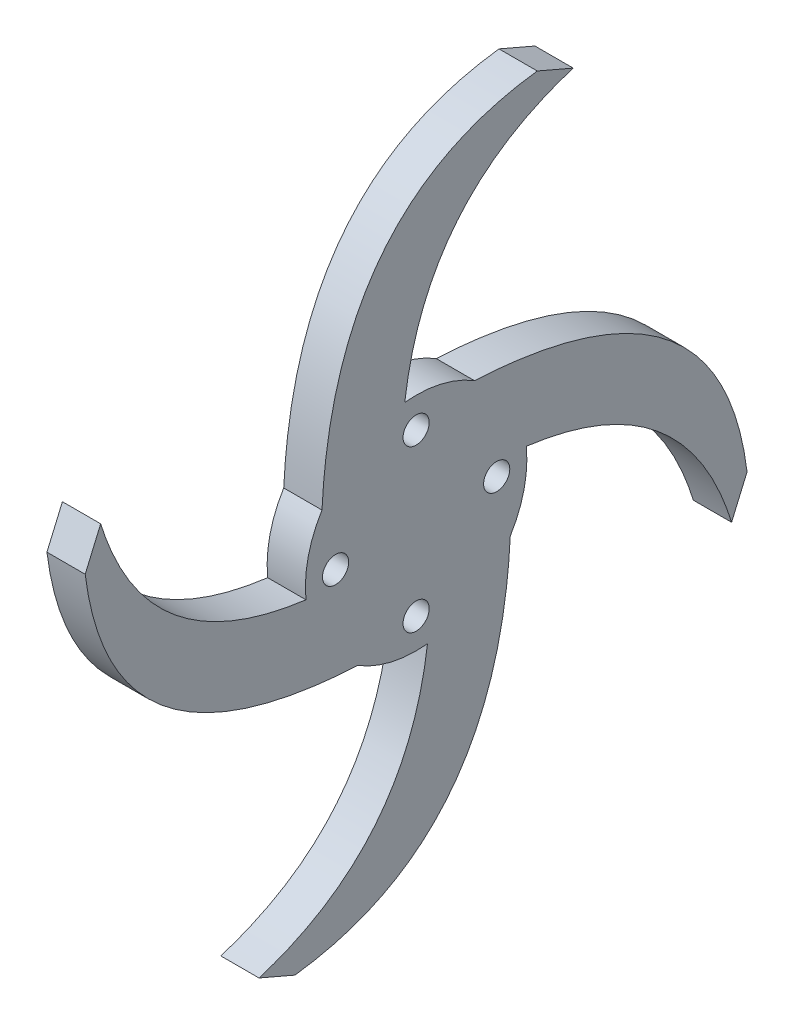
ISO-10303-21;
HEADER;
FILE_DESCRIPTION(('STEP AP214'),'2;1');
FILE_NAME('part.step','',(''),(''),'','','');
FILE_SCHEMA(('AUTOMOTIVE_DESIGN { 1 0 10303 214 1 1 1 1 }'));
ENDSEC;
DATA;
#1=APPLICATION_CONTEXT('core data for automotive mechanical design processes');
#2=APPLICATION_PROTOCOL_DEFINITION('international standard','automotive_design',2000,#1);
#3=PRODUCT_CONTEXT('',#1,'mechanical');
#4=PRODUCT('Part','Part','',(#3));
#5=PRODUCT_RELATED_PRODUCT_CATEGORY('part','',(#4));
#6=PRODUCT_DEFINITION_FORMATION('','',#4);
#7=PRODUCT_DEFINITION_CONTEXT('part definition',#1,'design');
#8=PRODUCT_DEFINITION('design','',#6,#7);
#9=PRODUCT_DEFINITION_SHAPE('','',#8);
#10=(LENGTH_UNIT() NAMED_UNIT(*) SI_UNIT(.MILLI.,.METRE.));
#11=(NAMED_UNIT(*) PLANE_ANGLE_UNIT() SI_UNIT($,.RADIAN.));
#12=(NAMED_UNIT(*) SI_UNIT($,.STERADIAN.) SOLID_ANGLE_UNIT());
#13=UNCERTAINTY_MEASURE_WITH_UNIT(LENGTH_MEASURE(1.E-05),#10,'distance_accuracy_value','');
#14=(GEOMETRIC_REPRESENTATION_CONTEXT(3) GLOBAL_UNCERTAINTY_ASSIGNED_CONTEXT((#13)) GLOBAL_UNIT_ASSIGNED_CONTEXT((#10,
#11,#12)) REPRESENTATION_CONTEXT('',''));
#15=CARTESIAN_POINT('',(0.,0.,0.));
#16=DIRECTION('',(0.,0.,1.));
#17=DIRECTION('',(1.,0.,0.));
#18=AXIS2_PLACEMENT_3D('',#15,#16,#17);
#19=CARTESIAN_POINT('',(4.826,0.,0.));
#20=DIRECTION('',(-1.,0.,0.));
#21=DIRECTION('',(0.,0.,1.));
#22=AXIS2_PLACEMENT_3D('',#19,#20,#21);
#23=CYLINDRICAL_SURFACE('',#22,13.97);
#24=CARTESIAN_POINT('',(4.826,0.,0.));
#25=DIRECTION('',(1.,0.,0.));
#26=DIRECTION('',(0.,0.,-1.));
#27=AXIS2_PLACEMENT_3D('',#24,#25,#26);
#28=CIRCLE('',#27,13.97);
#29=CARTESIAN_POINT('',(4.826,-11.8753208345837,7.35782950846934));
#30=VERTEX_POINT('',#29);
#31=CARTESIAN_POINT('',(4.826,-13.8960777758353,-1.43524299264486));
#32=VERTEX_POINT('',#31);
#33=EDGE_CURVE('E55',#30,#32,#28,.T.);
#34=ORIENTED_EDGE('',*,*,#33,.F.);
#35=DIRECTION('',(1.,0.,0.));
#36=VECTOR('',#35,1.);
#37=CARTESIAN_POINT('',(0.,-11.8753208345837,7.35782950846934));
#38=LINE('',#37,#36);
#39=CARTESIAN_POINT('',(0.,-11.8753208345837,7.35782950846934));
#40=VERTEX_POINT('',#39);
#41=EDGE_CURVE('E174',#40,#30,#38,.T.);
#42=ORIENTED_EDGE('',*,*,#41,.F.);
#43=CARTESIAN_POINT('',(0.,0.,0.));
#44=DIRECTION('',(1.,0.,0.));
#45=DIRECTION('',(0.,0.,-1.));
#46=AXIS2_PLACEMENT_3D('',#43,#44,#45);
#47=CIRCLE('',#46,13.97);
#48=CARTESIAN_POINT('',(0.,-13.8960777758353,-1.43524299264486));
#49=VERTEX_POINT('',#48);
#50=EDGE_CURVE('E453',#40,#49,#47,.T.);
#51=ORIENTED_EDGE('',*,*,#50,.T.);
#52=DIRECTION('',(1.,0.,0.));
#53=VECTOR('',#52,1.);
#54=CARTESIAN_POINT('',(0.,-13.8960777758353,-1.43524299264486));
#55=LINE('',#54,#53);
#56=EDGE_CURVE('E440',#49,#32,#55,.T.);
#57=ORIENTED_EDGE('',*,*,#56,.T.);
#58=EDGE_LOOP('',(#34,#42,#51,#57));
#59=FACE_BOUND('',#58,.T.);
#60=ADVANCED_FACE('F45',(#59),#23,.T.);
#61=CARTESIAN_POINT('',(4.826,-7.35782950846929,-11.8753208345837));
#62=VERTEX_POINT('',#61);
#63=CARTESIAN_POINT('',(4.826,1.43524299264491,-13.8960777758353));
#64=VERTEX_POINT('',#63);
#65=EDGE_CURVE('E444',#62,#64,#28,.T.);
#66=ORIENTED_EDGE('',*,*,#65,.F.);
#67=DIRECTION('',(1.,0.,0.));
#68=VECTOR('',#67,1.);
#69=CARTESIAN_POINT('',(0.,-7.3578295084693,-11.8753208345837));
#70=LINE('',#69,#68);
#71=CARTESIAN_POINT('',(0.,-7.3578295084693,-11.8753208345837));
#72=VERTEX_POINT('',#71);
#73=EDGE_CURVE('E468',#72,#62,#70,.T.);
#74=ORIENTED_EDGE('',*,*,#73,.F.);
#75=CARTESIAN_POINT('',(0.,1.43524299264491,-13.8960777758353));
#76=VERTEX_POINT('',#75);
#77=EDGE_CURVE('E458',#72,#76,#47,.T.);
#78=ORIENTED_EDGE('',*,*,#77,.T.);
#79=DIRECTION('',(1.,0.,0.));
#80=VECTOR('',#79,1.);
#81=CARTESIAN_POINT('',(0.,1.43524299264491,-13.8960777758353));
#82=LINE('',#81,#80);
#83=EDGE_CURVE('E255',#76,#64,#82,.T.);
#84=ORIENTED_EDGE('',*,*,#83,.T.);
#85=EDGE_LOOP('',(#66,#74,#78,#84));
#86=FACE_BOUND('',#85,.T.);
#87=ADVANCED_FACE('F431',(#86),#23,.T.);
#88=CARTESIAN_POINT('',(4.826,11.8753208345838,-7.35782950846926));
#89=VERTEX_POINT('',#88);
#90=CARTESIAN_POINT('',(4.826,13.8960777758353,1.43524299264496));
#91=VERTEX_POINT('',#90);
#92=EDGE_CURVE('E56',#89,#91,#28,.T.);
#93=ORIENTED_EDGE('',*,*,#92,.F.);
#94=DIRECTION('',(1.,0.,0.));
#95=VECTOR('',#94,1.);
#96=CARTESIAN_POINT('',(0.,11.8753208345838,-7.35782950846926));
#97=LINE('',#96,#95);
#98=CARTESIAN_POINT('',(0.,11.8753208345838,-7.35782950846926));
#99=VERTEX_POINT('',#98);
#100=EDGE_CURVE('E247',#99,#89,#97,.T.);
#101=ORIENTED_EDGE('',*,*,#100,.F.);
#102=CARTESIAN_POINT('',(0.,13.8960777758353,1.43524299264496));
#103=VERTEX_POINT('',#102);
#104=EDGE_CURVE('E407',#99,#103,#47,.T.);
#105=ORIENTED_EDGE('',*,*,#104,.T.);
#106=DIRECTION('',(1.,0.,0.));
#107=VECTOR('',#106,1.);
#108=CARTESIAN_POINT('',(0.,13.8960777758353,1.43524299264496));
#109=LINE('',#108,#107);
#110=EDGE_CURVE('E372',#103,#91,#109,.T.);
#111=ORIENTED_EDGE('',*,*,#110,.T.);
#112=EDGE_LOOP('',(#93,#101,#105,#111));
#113=FACE_BOUND('',#112,.T.);
#114=ADVANCED_FACE('F428',(#113),#23,.T.);
#115=CARTESIAN_POINT('',(4.826,0.,0.));
#116=DIRECTION('',(1.,0.,0.));
#117=DIRECTION('',(0.,0.,-1.));
#118=AXIS2_PLACEMENT_3D('',#115,#116,#117);
#119=PLANE('',#118);
#120=CARTESIAN_POINT('',(4.826,7.35782950846922,11.8753208345838));
#121=VERTEX_POINT('',#120);
#122=CARTESIAN_POINT('',(4.826,-1.43524299264482,13.8960777758353));
#123=VERTEX_POINT('',#122);
#124=EDGE_CURVE('E11',#121,#123,#28,.T.);
#125=ORIENTED_EDGE('',*,*,#124,.T.);
#126=CARTESIAN_POINT('',(4.826,-1.4352429926449,13.896077775835));
#127=CARTESIAN_POINT('',(4.826,1.16440929630114,34.0043615109864));
#128=CARTESIAN_POINT('',(4.826,19.8137376694634,39.7896757911606));
#129=B_SPLINE_CURVE_WITH_KNOTS('',2,(#126,#127,#128),.UNSPECIFIED.,.F.,.F.,(3,3),(0.,1.),.UNSPECIFIED.);
#130=CARTESIAN_POINT('',(4.826,19.8137376694634,39.7896757911606));
#131=VERTEX_POINT('',#130);
#132=EDGE_CURVE('E178',#123,#131,#129,.T.);
#133=ORIENTED_EDGE('',*,*,#132,.T.);
#134=DIRECTION('',(0.,-0.918533630164432,0.395342851531364));
#135=VECTOR('',#134,1.);
#136=CARTESIAN_POINT('',(4.826,15.2779809440673,41.7418950009785));
#137=LINE('',#136,#135);
#138=CARTESIAN_POINT('',(4.826,15.2779809440673,41.7418950009785));
#139=VERTEX_POINT('',#138);
#140=EDGE_CURVE('E164',#131,#139,#137,.T.);
#141=ORIENTED_EDGE('',*,*,#140,.T.);
#142=CARTESIAN_POINT('',(4.826,15.277980944067,41.7418950009784));
#143=CARTESIAN_POINT('',(4.826,-10.2852485215393,38.5477730290514));
#144=CARTESIAN_POINT('',(4.826,-11.8753208345837,7.35782950846895));
#145=B_SPLINE_CURVE_WITH_KNOTS('',2,(#142,#143,#144),.UNSPECIFIED.,.F.,.F.,(3,3),(0.,1.),.UNSPECIFIED.);
#146=EDGE_CURVE('E63',#139,#30,#145,.T.);
#147=ORIENTED_EDGE('',*,*,#146,.T.);
#148=ORIENTED_EDGE('',*,*,#33,.T.);
#149=CARTESIAN_POINT('',(4.826,-13.896077775835,-1.43524299264517));
#150=CARTESIAN_POINT('',(4.826,-34.0043615109863,1.16440929630097));
#151=CARTESIAN_POINT('',(4.826,-39.7896757911605,19.8137376694631));
#152=B_SPLINE_CURVE_WITH_KNOTS('',2,(#149,#150,#151),.UNSPECIFIED.,.F.,.F.,(3,3),(0.,1.),.UNSPECIFIED.);
#153=CARTESIAN_POINT('',(4.826,-39.7896757911605,19.8137376694631));
#154=VERTEX_POINT('',#153);
#155=EDGE_CURVE('E495',#32,#154,#152,.T.);
#156=ORIENTED_EDGE('',*,*,#155,.T.);
#157=DIRECTION('',(0.,-0.395342851531361,-0.918533630164433));
#158=VECTOR('',#157,1.);
#159=CARTESIAN_POINT('',(4.826,-41.7418950009786,15.2779809440672));
#160=LINE('',#159,#158);
#161=CARTESIAN_POINT('',(4.826,-41.7418950009786,15.2779809440672));
#162=VERTEX_POINT('',#161);
#163=EDGE_CURVE('E241',#154,#162,#160,.T.);
#164=ORIENTED_EDGE('',*,*,#163,.T.);
#165=CARTESIAN_POINT('',(4.826,-41.7418950009783,15.2779809440667));
#166=CARTESIAN_POINT('',(4.826,-38.5477730290514,-10.2852485215395));
#167=CARTESIAN_POINT('',(4.826,-7.35782950846888,-11.875320834584));
#168=B_SPLINE_CURVE_WITH_KNOTS('',2,(#165,#166,#167),.UNSPECIFIED.,.F.,.F.,(3,3),(0.,1.),.UNSPECIFIED.);
#169=EDGE_CURVE('E70',#162,#62,#168,.T.);
#170=ORIENTED_EDGE('',*,*,#169,.T.);
#171=ORIENTED_EDGE('',*,*,#65,.T.);
#172=CARTESIAN_POINT('',(4.826,1.43524299264523,-13.8960777758352));
#173=CARTESIAN_POINT('',(4.826,-1.16440929630107,-34.0043615109864));
#174=CARTESIAN_POINT('',(4.826,-19.813737669463,-39.7896757911608));
#175=B_SPLINE_CURVE_WITH_KNOTS('',2,(#172,#173,#174),.UNSPECIFIED.,.F.,.F.,(3,3),(0.,1.),.UNSPECIFIED.);
#176=CARTESIAN_POINT('',(4.826,-19.813737669463,-39.7896757911608));
#177=VERTEX_POINT('',#176);
#178=EDGE_CURVE('E269',#64,#177,#175,.T.);
#179=ORIENTED_EDGE('',*,*,#178,.T.);
#180=DIRECTION('',(0.,0.918533630164435,-0.395342851531357));
#181=VECTOR('',#180,1.);
#182=CARTESIAN_POINT('',(4.826,-15.2779809440671,-41.7418950009786));
#183=LINE('',#182,#181);
#184=CARTESIAN_POINT('',(4.826,-15.2779809440671,-41.7418950009786));
#185=VERTEX_POINT('',#184);
#186=EDGE_CURVE('E265',#177,#185,#183,.T.);
#187=ORIENTED_EDGE('',*,*,#186,.T.);
#188=CARTESIAN_POINT('',(4.826,-15.2779809440666,-41.7418950009786));
#189=CARTESIAN_POINT('',(4.826,10.2852485215394,-38.5477730290512));
#190=CARTESIAN_POINT('',(4.826,11.8753208345841,-7.35782950846915));
#191=B_SPLINE_CURVE_WITH_KNOTS('',2,(#188,#189,#190),.UNSPECIFIED.,.F.,.F.,(3,3),(0.,1.),.UNSPECIFIED.);
#192=EDGE_CURVE('E276',#185,#89,#191,.T.);
#193=ORIENTED_EDGE('',*,*,#192,.T.);
#194=ORIENTED_EDGE('',*,*,#92,.T.);
#195=CARTESIAN_POINT('',(4.826,13.8960777758353,1.43524299264496));
#196=CARTESIAN_POINT('',(4.826,34.0043615109867,-1.16440929630094));
#197=CARTESIAN_POINT('',(4.826,39.7896757911608,-19.8137376694633));
#198=B_SPLINE_CURVE_WITH_KNOTS('',2,(#195,#196,#197),.UNSPECIFIED.,.F.,.F.,(3,3),(0.,1.),.UNSPECIFIED.);
#199=CARTESIAN_POINT('',(4.826,39.7896757911608,-19.8137376694633));
#200=VERTEX_POINT('',#199);
#201=EDGE_CURVE('E349',#91,#200,#198,.T.);
#202=ORIENTED_EDGE('',*,*,#201,.T.);
#203=DIRECTION('',(0.,0.395342851531354,0.918533630164437));
#204=VECTOR('',#203,1.);
#205=CARTESIAN_POINT('',(4.826,41.7418950009787,-15.2779809440669));
#206=LINE('',#205,#204);
#207=CARTESIAN_POINT('',(4.826,41.7418950009787,-15.2779809440669));
#208=VERTEX_POINT('',#207);
#209=EDGE_CURVE('E358',#200,#208,#206,.T.);
#210=ORIENTED_EDGE('',*,*,#209,.T.);
#211=CARTESIAN_POINT('',(4.826,41.7418950009787,-15.2779809440669));
#212=CARTESIAN_POINT('',(4.826,38.5477730290516,10.2852485215394));
#213=CARTESIAN_POINT('',(4.826,7.35782950846922,11.8753208345838));
#214=B_SPLINE_CURVE_WITH_KNOTS('',2,(#211,#212,#213),.UNSPECIFIED.,.F.,.F.,(3,3),(0.,1.),.UNSPECIFIED.);
#215=EDGE_CURVE('E284',#208,#121,#214,.T.);
#216=ORIENTED_EDGE('',*,*,#215,.T.);
#217=EDGE_LOOP('',(#125,#133,#141,#147,#148,#156,#164,#170,#171,#179,#187,#193,#194,#202,#210,#216));
#218=FACE_BOUND('',#217,.T.);
#219=CARTESIAN_POINT('',(4.826,0.,-10.16));
#220=DIRECTION('',(1.,0.,0.));
#221=DIRECTION('',(0.,0.,-1.));
#222=AXIS2_PLACEMENT_3D('',#219,#220,#221);
#223=CIRCLE('',#222,1.651);
#224=CARTESIAN_POINT('',(4.826,0.,-11.811));
#225=VERTEX_POINT('',#224);
#226=EDGE_CURVE('E387',#225,#225,#223,.T.);
#227=ORIENTED_EDGE('',*,*,#226,.F.);
#228=EDGE_LOOP('',(#227));
#229=FACE_BOUND('',#228,.T.);
#230=CARTESIAN_POINT('',(4.826,0.,10.16));
#231=DIRECTION('',(1.,0.,0.));
#232=DIRECTION('',(0.,0.,-1.));
#233=AXIS2_PLACEMENT_3D('',#230,#231,#232);
#234=CIRCLE('',#233,1.651);
#235=CARTESIAN_POINT('',(4.826,0.,8.509));
#236=VERTEX_POINT('',#235);
#237=EDGE_CURVE('E403',#236,#236,#234,.T.);
#238=ORIENTED_EDGE('',*,*,#237,.F.);
#239=EDGE_LOOP('',(#238));
#240=FACE_BOUND('',#239,.T.);
#241=CARTESIAN_POINT('',(4.826,10.16,0.));
#242=DIRECTION('',(1.,0.,0.));
#243=DIRECTION('',(0.,0.,-1.));
#244=AXIS2_PLACEMENT_3D('',#241,#242,#243);
#245=CIRCLE('',#244,1.651);
#246=CARTESIAN_POINT('',(4.826,10.16,-1.65100000000003));
#247=VERTEX_POINT('',#246);
#248=EDGE_CURVE('E395',#247,#247,#245,.T.);
#249=ORIENTED_EDGE('',*,*,#248,.F.);
#250=EDGE_LOOP('',(#249));
#251=FACE_BOUND('',#250,.T.);
#252=CARTESIAN_POINT('',(4.826,-10.16,1.06420351207939E-13));
#253=DIRECTION('',(1.,0.,0.));
#254=DIRECTION('',(0.,0.,-1.));
#255=AXIS2_PLACEMENT_3D('',#252,#253,#254);
#256=CIRCLE('',#255,1.651);
#257=CARTESIAN_POINT('',(4.826,-10.16,-1.65099999999989));
#258=VERTEX_POINT('',#257);
#259=EDGE_CURVE('E379',#258,#258,#256,.T.);
#260=ORIENTED_EDGE('',*,*,#259,.F.);
#261=EDGE_LOOP('',(#260));
#262=FACE_BOUND('',#261,.T.);
#263=ADVANCED_FACE('F181',(#218,#229,#240,#251,#262),#119,.T.);
#264=CARTESIAN_POINT('',(0.,0.,0.));
#265=DIRECTION('',(1.,0.,0.));
#266=DIRECTION('',(0.,0.,-1.));
#267=AXIS2_PLACEMENT_3D('',#264,#265,#266);
#268=PLANE('',#267);
#269=ORIENTED_EDGE('',*,*,#50,.F.);
#270=CARTESIAN_POINT('',(0.,15.277980944067,41.7418950009784));
#271=CARTESIAN_POINT('',(0.,-10.2852485215393,38.5477730290514));
#272=CARTESIAN_POINT('',(0.,-11.8753208345837,7.35782950846895));
#273=B_SPLINE_CURVE_WITH_KNOTS('',2,(#270,#271,#272),.UNSPECIFIED.,.F.,.F.,(3,3),(0.,1.),.UNSPECIFIED.);
#274=CARTESIAN_POINT('',(0.,15.2779809440673,41.7418950009785));
#275=VERTEX_POINT('',#274);
#276=EDGE_CURVE('E184',#275,#40,#273,.T.);
#277=ORIENTED_EDGE('',*,*,#276,.F.);
#278=DIRECTION('',(0.,-0.918533630164432,0.395342851531364));
#279=VECTOR('',#278,1.);
#280=CARTESIAN_POINT('',(0.,15.2779809440673,41.7418950009785));
#281=LINE('',#280,#279);
#282=CARTESIAN_POINT('',(0.,19.8137376694634,39.7896757911606));
#283=VERTEX_POINT('',#282);
#284=EDGE_CURVE('E166',#283,#275,#281,.T.);
#285=ORIENTED_EDGE('',*,*,#284,.F.);
#286=CARTESIAN_POINT('',(0.,-1.4352429926449,13.896077775835));
#287=CARTESIAN_POINT('',(0.,1.16440929630114,34.0043615109864));
#288=CARTESIAN_POINT('',(0.,19.8137376694634,39.7896757911606));
#289=B_SPLINE_CURVE_WITH_KNOTS('',2,(#286,#287,#288),.UNSPECIFIED.,.F.,.F.,(3,3),(0.,1.),.UNSPECIFIED.);
#290=CARTESIAN_POINT('',(0.,-1.43524299264482,13.8960777758353));
#291=VERTEX_POINT('',#290);
#292=EDGE_CURVE('E189',#291,#283,#289,.T.);
#293=ORIENTED_EDGE('',*,*,#292,.F.);
#294=CARTESIAN_POINT('',(0.,7.35782950846922,11.8753208345838));
#295=VERTEX_POINT('',#294);
#296=EDGE_CURVE('E49',#295,#291,#47,.T.);
#297=ORIENTED_EDGE('',*,*,#296,.F.);
#298=CARTESIAN_POINT('',(0.,41.7418950009787,-15.2779809440669));
#299=CARTESIAN_POINT('',(0.,38.5477730290516,10.2852485215394));
#300=CARTESIAN_POINT('',(0.,7.35782950846922,11.8753208345838));
#301=B_SPLINE_CURVE_WITH_KNOTS('',2,(#298,#299,#300),.UNSPECIFIED.,.F.,.F.,(3,3),(0.,1.),.UNSPECIFIED.);
#302=CARTESIAN_POINT('',(0.,41.7418950009787,-15.2779809440669));
#303=VERTEX_POINT('',#302);
#304=EDGE_CURVE('E334',#303,#295,#301,.T.);
#305=ORIENTED_EDGE('',*,*,#304,.F.);
#306=DIRECTION('',(0.,0.395342851531354,0.918533630164437));
#307=VECTOR('',#306,1.);
#308=CARTESIAN_POINT('',(0.,41.7418950009787,-15.2779809440669));
#309=LINE('',#308,#307);
#310=CARTESIAN_POINT('',(0.,39.7896757911608,-19.8137376694633));
#311=VERTEX_POINT('',#310);
#312=EDGE_CURVE('E333',#311,#303,#309,.T.);
#313=ORIENTED_EDGE('',*,*,#312,.F.);
#314=CARTESIAN_POINT('',(0.,13.8960777758353,1.43524299264496));
#315=CARTESIAN_POINT('',(0.,34.0043615109867,-1.16440929630094));
#316=CARTESIAN_POINT('',(0.,39.7896757911608,-19.8137376694633));
#317=B_SPLINE_CURVE_WITH_KNOTS('',2,(#314,#315,#316),.UNSPECIFIED.,.F.,.F.,(3,3),(0.,1.),.UNSPECIFIED.);
#318=EDGE_CURVE('E326',#103,#311,#317,.T.);
#319=ORIENTED_EDGE('',*,*,#318,.F.);
#320=ORIENTED_EDGE('',*,*,#104,.F.);
#321=CARTESIAN_POINT('',(0.,-15.2779809440666,-41.7418950009786));
#322=CARTESIAN_POINT('',(0.,10.2852485215394,-38.5477730290512));
#323=CARTESIAN_POINT('',(0.,11.8753208345841,-7.35782950846915));
#324=B_SPLINE_CURVE_WITH_KNOTS('',2,(#321,#322,#323),.UNSPECIFIED.,.F.,.F.,(3,3),(0.,1.),.UNSPECIFIED.);
#325=CARTESIAN_POINT('',(0.,-15.2779809440671,-41.7418950009786));
#326=VERTEX_POINT('',#325);
#327=EDGE_CURVE('E270',#326,#99,#324,.T.);
#328=ORIENTED_EDGE('',*,*,#327,.F.);
#329=DIRECTION('',(0.,0.918533630164435,-0.395342851531357));
#330=VECTOR('',#329,1.);
#331=CARTESIAN_POINT('',(0.,-15.2779809440671,-41.7418950009786));
#332=LINE('',#331,#330);
#333=CARTESIAN_POINT('',(0.,-19.813737669463,-39.7896757911608));
#334=VERTEX_POINT('',#333);
#335=EDGE_CURVE('E254',#334,#326,#332,.T.);
#336=ORIENTED_EDGE('',*,*,#335,.F.);
#337=CARTESIAN_POINT('',(0.,1.43524299264523,-13.8960777758352));
#338=CARTESIAN_POINT('',(0.,-1.16440929630107,-34.0043615109864));
#339=CARTESIAN_POINT('',(0.,-19.813737669463,-39.7896757911608));
#340=B_SPLINE_CURVE_WITH_KNOTS('',2,(#337,#338,#339),.UNSPECIFIED.,.F.,.F.,(3,3),(0.,1.),.UNSPECIFIED.);
#341=EDGE_CURVE('E291',#76,#334,#340,.T.);
#342=ORIENTED_EDGE('',*,*,#341,.F.);
#343=ORIENTED_EDGE('',*,*,#77,.F.);
#344=CARTESIAN_POINT('',(0.,-41.7418950009783,15.2779809440667));
#345=CARTESIAN_POINT('',(0.,-38.5477730290514,-10.2852485215395));
#346=CARTESIAN_POINT('',(0.,-7.35782950846888,-11.875320834584));
#347=B_SPLINE_CURVE_WITH_KNOTS('',2,(#344,#345,#346),.UNSPECIFIED.,.F.,.F.,(3,3),(0.,1.),.UNSPECIFIED.);
#348=CARTESIAN_POINT('',(0.,-41.7418950009786,15.2779809440672));
#349=VERTEX_POINT('',#348);
#350=EDGE_CURVE('E235',#349,#72,#347,.T.);
#351=ORIENTED_EDGE('',*,*,#350,.F.);
#352=DIRECTION('',(0.,-0.395342851531361,-0.918533630164433));
#353=VECTOR('',#352,1.);
#354=CARTESIAN_POINT('',(0.,-41.7418950009786,15.2779809440672));
#355=LINE('',#354,#353);
#356=CARTESIAN_POINT('',(0.,-39.7896757911605,19.8137376694631));
#357=VERTEX_POINT('',#356);
#358=EDGE_CURVE('E501',#357,#349,#355,.T.);
#359=ORIENTED_EDGE('',*,*,#358,.F.);
#360=CARTESIAN_POINT('',(0.,-13.896077775835,-1.43524299264517));
#361=CARTESIAN_POINT('',(0.,-34.0043615109863,1.16440929630097));
#362=CARTESIAN_POINT('',(0.,-39.7896757911605,19.8137376694631));
#363=B_SPLINE_CURVE_WITH_KNOTS('',2,(#360,#361,#362),.UNSPECIFIED.,.F.,.F.,(3,3),(0.,1.),.UNSPECIFIED.);
#364=EDGE_CURVE('E242',#49,#357,#363,.T.);
#365=ORIENTED_EDGE('',*,*,#364,.F.);
#366=EDGE_LOOP('',(#269,#277,#285,#293,#297,#305,#313,#319,#320,#328,#336,#342,#343,#351,#359,#365));
#367=FACE_BOUND('',#366,.T.);
#368=CARTESIAN_POINT('',(0.,0.,10.16));
#369=DIRECTION('',(1.,0.,0.));
#370=DIRECTION('',(0.,0.,-1.));
#371=AXIS2_PLACEMENT_3D('',#368,#369,#370);
#372=CIRCLE('',#371,1.651);
#373=CARTESIAN_POINT('',(0.,0.,8.509));
#374=VERTEX_POINT('',#373);
#375=EDGE_CURVE('E399',#374,#374,#372,.T.);
#376=ORIENTED_EDGE('',*,*,#375,.T.);
#377=EDGE_LOOP('',(#376));
#378=FACE_BOUND('',#377,.T.);
#379=CARTESIAN_POINT('',(0.,10.16,0.));
#380=DIRECTION('',(1.,0.,0.));
#381=DIRECTION('',(0.,0.,-1.));
#382=AXIS2_PLACEMENT_3D('',#379,#380,#381);
#383=CIRCLE('',#382,1.651);
#384=CARTESIAN_POINT('',(0.,10.16,-1.65100000000003));
#385=VERTEX_POINT('',#384);
#386=EDGE_CURVE('E391',#385,#385,#383,.T.);
#387=ORIENTED_EDGE('',*,*,#386,.T.);
#388=EDGE_LOOP('',(#387));
#389=FACE_BOUND('',#388,.T.);
#390=CARTESIAN_POINT('',(0.,0.,-10.16));
#391=DIRECTION('',(1.,0.,0.));
#392=DIRECTION('',(0.,0.,-1.));
#393=AXIS2_PLACEMENT_3D('',#390,#391,#392);
#394=CIRCLE('',#393,1.651);
#395=CARTESIAN_POINT('',(0.,0.,-11.811));
#396=VERTEX_POINT('',#395);
#397=EDGE_CURVE('E383',#396,#396,#394,.T.);
#398=ORIENTED_EDGE('',*,*,#397,.T.);
#399=EDGE_LOOP('',(#398));
#400=FACE_BOUND('',#399,.T.);
#401=CARTESIAN_POINT('',(0.,-10.16,1.06420351207939E-13));
#402=DIRECTION('',(1.,0.,0.));
#403=DIRECTION('',(0.,0.,-1.));
#404=AXIS2_PLACEMENT_3D('',#401,#402,#403);
#405=CIRCLE('',#404,1.651);
#406=CARTESIAN_POINT('',(0.,-10.16,-1.65099999999989));
#407=VERTEX_POINT('',#406);
#408=EDGE_CURVE('E368',#407,#407,#405,.T.);
#409=ORIENTED_EDGE('',*,*,#408,.T.);
#410=EDGE_LOOP('',(#409));
#411=FACE_BOUND('',#410,.T.);
#412=ADVANCED_FACE('F412',(#367,#378,#389,#400,#411),#268,.F.);
#413=ORIENTED_EDGE('',*,*,#296,.T.);
#414=DIRECTION('',(1.,0.,0.));
#415=VECTOR('',#414,1.);
#416=CARTESIAN_POINT('',(0.,-1.43524299264482,13.8960777758353));
#417=LINE('',#416,#415);
#418=EDGE_CURVE('E484',#291,#123,#417,.T.);
#419=ORIENTED_EDGE('',*,*,#418,.T.);
#420=ORIENTED_EDGE('',*,*,#124,.F.);
#421=DIRECTION('',(1.,0.,0.));
#422=VECTOR('',#421,1.);
#423=CARTESIAN_POINT('',(0.,7.35782950846922,11.8753208345838));
#424=LINE('',#423,#422);
#425=EDGE_CURVE('E344',#295,#121,#424,.T.);
#426=ORIENTED_EDGE('',*,*,#425,.F.);
#427=EDGE_LOOP('',(#413,#419,#420,#426));
#428=FACE_BOUND('',#427,.T.);
#429=ADVANCED_FACE('F47',(#428),#23,.T.);
#430=CARTESIAN_POINT('',(4.826,0.,10.16));
#431=DIRECTION('',(-1.,0.,0.));
#432=DIRECTION('',(0.,0.,1.));
#433=AXIS2_PLACEMENT_3D('',#430,#431,#432);
#434=CYLINDRICAL_SURFACE('',#433,1.651);
#435=ORIENTED_EDGE('',*,*,#237,.T.);
#436=EDGE_LOOP('',(#435));
#437=FACE_BOUND('',#436,.T.);
#438=ORIENTED_EDGE('',*,*,#375,.F.);
#439=EDGE_LOOP('',(#438));
#440=FACE_BOUND('',#439,.T.);
#441=ADVANCED_FACE('F415',(#437,#440),#434,.F.);
#442=CARTESIAN_POINT('',(4.826,10.16,0.));
#443=DIRECTION('',(-1.,0.,0.));
#444=DIRECTION('',(0.,0.,1.));
#445=AXIS2_PLACEMENT_3D('',#442,#443,#444);
#446=CYLINDRICAL_SURFACE('',#445,1.651);
#447=ORIENTED_EDGE('',*,*,#248,.T.);
#448=EDGE_LOOP('',(#447));
#449=FACE_BOUND('',#448,.T.);
#450=ORIENTED_EDGE('',*,*,#386,.F.);
#451=EDGE_LOOP('',(#450));
#452=FACE_BOUND('',#451,.T.);
#453=ADVANCED_FACE('F417',(#449,#452),#446,.F.);
#454=CARTESIAN_POINT('',(4.826,0.,-10.16));
#455=DIRECTION('',(-1.,0.,0.));
#456=DIRECTION('',(0.,0.,1.));
#457=AXIS2_PLACEMENT_3D('',#454,#455,#456);
#458=CYLINDRICAL_SURFACE('',#457,1.651);
#459=ORIENTED_EDGE('',*,*,#226,.T.);
#460=EDGE_LOOP('',(#459));
#461=FACE_BOUND('',#460,.T.);
#462=ORIENTED_EDGE('',*,*,#397,.F.);
#463=EDGE_LOOP('',(#462));
#464=FACE_BOUND('',#463,.T.);
#465=ADVANCED_FACE('F424',(#461,#464),#458,.F.);
#466=CARTESIAN_POINT('',(4.826,-10.16,1.06420351207939E-13));
#467=DIRECTION('',(-1.,0.,0.));
#468=DIRECTION('',(0.,0.,1.));
#469=AXIS2_PLACEMENT_3D('',#466,#467,#468);
#470=CYLINDRICAL_SURFACE('',#469,1.651);
#471=ORIENTED_EDGE('',*,*,#259,.T.);
#472=EDGE_LOOP('',(#471));
#473=FACE_BOUND('',#472,.T.);
#474=ORIENTED_EDGE('',*,*,#408,.F.);
#475=EDGE_LOOP('',(#474));
#476=FACE_BOUND('',#475,.T.);
#477=ADVANCED_FACE('F621',(#473,#476),#470,.F.);
#478=DIRECTION('',(1.,0.,0.));
#479=VECTOR('',#478,1.);
#480=SURFACE_OF_LINEAR_EXTRUSION('',#301,#479);
#481=ORIENTED_EDGE('',*,*,#215,.F.);
#482=DIRECTION('',(1.,0.,0.));
#483=VECTOR('',#482,1.);
#484=CARTESIAN_POINT('',(0.,41.7418950009787,-15.2779809440669));
#485=LINE('',#484,#483);
#486=EDGE_CURVE('E365',#303,#208,#485,.T.);
#487=ORIENTED_EDGE('',*,*,#486,.F.);
#488=ORIENTED_EDGE('',*,*,#304,.T.);
#489=ORIENTED_EDGE('',*,*,#425,.T.);
#490=EDGE_LOOP('',(#481,#487,#488,#489));
#491=FACE_BOUND('',#490,.T.);
#492=ADVANCED_FACE('F319',(#491),#480,.T.);
#493=CARTESIAN_POINT('',(0.,41.7418950009787,-15.2779809440669));
#494=DIRECTION('',(0.,0.918533630164436,-0.395342851531354));
#495=DIRECTION('',(0.,0.395342851531354,0.918533630164437));
#496=AXIS2_PLACEMENT_3D('',#493,#494,#495);
#497=PLANE('',#496);
#498=ORIENTED_EDGE('',*,*,#209,.F.);
#499=DIRECTION('',(1.,0.,0.));
#500=VECTOR('',#499,1.);
#501=CARTESIAN_POINT('',(0.,39.7896757911608,-19.8137376694633));
#502=LINE('',#501,#500);
#503=EDGE_CURVE('E369',#311,#200,#502,.T.);
#504=ORIENTED_EDGE('',*,*,#503,.F.);
#505=ORIENTED_EDGE('',*,*,#312,.T.);
#506=ORIENTED_EDGE('',*,*,#486,.T.);
#507=EDGE_LOOP('',(#498,#504,#505,#506));
#508=FACE_BOUND('',#507,.T.);
#509=ADVANCED_FACE('F315',(#508),#497,.T.);
#510=DIRECTION('',(1.,0.,0.));
#511=VECTOR('',#510,1.);
#512=SURFACE_OF_LINEAR_EXTRUSION('',#317,#511);
#513=ORIENTED_EDGE('',*,*,#201,.F.);
#514=ORIENTED_EDGE('',*,*,#110,.F.);
#515=ORIENTED_EDGE('',*,*,#318,.T.);
#516=ORIENTED_EDGE('',*,*,#503,.T.);
#517=EDGE_LOOP('',(#513,#514,#515,#516));
#518=FACE_BOUND('',#517,.T.);
#519=ADVANCED_FACE('F318',(#518),#512,.T.);
#520=DIRECTION('',(1.,0.,0.));
#521=VECTOR('',#520,1.);
#522=SURFACE_OF_LINEAR_EXTRUSION('',#324,#521);
#523=ORIENTED_EDGE('',*,*,#192,.F.);
#524=DIRECTION('',(1.,0.,0.));
#525=VECTOR('',#524,1.);
#526=CARTESIAN_POINT('',(0.,-15.2779809440671,-41.7418950009786));
#527=LINE('',#526,#525);
#528=EDGE_CURVE('E262',#326,#185,#527,.T.);
#529=ORIENTED_EDGE('',*,*,#528,.F.);
#530=ORIENTED_EDGE('',*,*,#327,.T.);
#531=ORIENTED_EDGE('',*,*,#100,.T.);
#532=EDGE_LOOP('',(#523,#529,#530,#531));
#533=FACE_BOUND('',#532,.T.);
#534=ADVANCED_FACE('F311',(#533),#522,.T.);
#535=CARTESIAN_POINT('',(0.,-15.2779809440671,-41.7418950009786));
#536=DIRECTION('',(0.,-0.395342851531357,-0.918533630164435));
#537=DIRECTION('',(0.,0.918533630164435,-0.395342851531357));
#538=AXIS2_PLACEMENT_3D('',#535,#536,#537);
#539=PLANE('',#538);
#540=ORIENTED_EDGE('',*,*,#186,.F.);
#541=DIRECTION('',(1.,0.,0.));
#542=VECTOR('',#541,1.);
#543=CARTESIAN_POINT('',(0.,-19.813737669463,-39.7896757911608));
#544=LINE('',#543,#542);
#545=EDGE_CURVE('E259',#334,#177,#544,.T.);
#546=ORIENTED_EDGE('',*,*,#545,.F.);
#547=ORIENTED_EDGE('',*,*,#335,.T.);
#548=ORIENTED_EDGE('',*,*,#528,.T.);
#549=EDGE_LOOP('',(#540,#546,#547,#548));
#550=FACE_BOUND('',#549,.T.);
#551=ADVANCED_FACE('F309',(#550),#539,.T.);
#552=DIRECTION('',(1.,0.,0.));
#553=VECTOR('',#552,1.);
#554=SURFACE_OF_LINEAR_EXTRUSION('',#340,#553);
#555=ORIENTED_EDGE('',*,*,#178,.F.);
#556=ORIENTED_EDGE('',*,*,#83,.F.);
#557=ORIENTED_EDGE('',*,*,#341,.T.);
#558=ORIENTED_EDGE('',*,*,#545,.T.);
#559=EDGE_LOOP('',(#555,#556,#557,#558));
#560=FACE_BOUND('',#559,.T.);
#561=ADVANCED_FACE('F230',(#560),#554,.T.);
#562=DIRECTION('',(1.,0.,0.));
#563=VECTOR('',#562,1.);
#564=SURFACE_OF_LINEAR_EXTRUSION('',#347,#563);
#565=ORIENTED_EDGE('',*,*,#169,.F.);
#566=DIRECTION('',(1.,0.,0.));
#567=VECTOR('',#566,1.);
#568=CARTESIAN_POINT('',(0.,-41.7418950009786,15.2779809440672));
#569=LINE('',#568,#567);
#570=EDGE_CURVE('E177',#349,#162,#569,.T.);
#571=ORIENTED_EDGE('',*,*,#570,.F.);
#572=ORIENTED_EDGE('',*,*,#350,.T.);
#573=ORIENTED_EDGE('',*,*,#73,.T.);
#574=EDGE_LOOP('',(#565,#571,#572,#573));
#575=FACE_BOUND('',#574,.T.);
#576=ADVANCED_FACE('F225',(#575),#564,.T.);
#577=CARTESIAN_POINT('',(0.,-41.7418950009786,15.2779809440672));
#578=DIRECTION('',(0.,-0.918533630164434,0.395342851531361));
#579=DIRECTION('',(0.,-0.395342851531361,-0.918533630164434));
#580=AXIS2_PLACEMENT_3D('',#577,#578,#579);
#581=PLANE('',#580);
#582=ORIENTED_EDGE('',*,*,#163,.F.);
#583=DIRECTION('',(1.,0.,0.));
#584=VECTOR('',#583,1.);
#585=CARTESIAN_POINT('',(0.,-39.7896757911605,19.8137376694631));
#586=LINE('',#585,#584);
#587=EDGE_CURVE('E497',#357,#154,#586,.T.);
#588=ORIENTED_EDGE('',*,*,#587,.F.);
#589=ORIENTED_EDGE('',*,*,#358,.T.);
#590=ORIENTED_EDGE('',*,*,#570,.T.);
#591=EDGE_LOOP('',(#582,#588,#589,#590));
#592=FACE_BOUND('',#591,.T.);
#593=ADVANCED_FACE('F229',(#592),#581,.T.);
#594=DIRECTION('',(1.,0.,0.));
#595=VECTOR('',#594,1.);
#596=SURFACE_OF_LINEAR_EXTRUSION('',#363,#595);
#597=ORIENTED_EDGE('',*,*,#155,.F.);
#598=ORIENTED_EDGE('',*,*,#56,.F.);
#599=ORIENTED_EDGE('',*,*,#364,.T.);
#600=ORIENTED_EDGE('',*,*,#587,.T.);
#601=EDGE_LOOP('',(#597,#598,#599,#600));
#602=FACE_BOUND('',#601,.T.);
#603=ADVANCED_FACE('F232',(#602),#596,.T.);
#604=DIRECTION('',(1.,0.,0.));
#605=VECTOR('',#604,1.);
#606=SURFACE_OF_LINEAR_EXTRUSION('',#273,#605);
#607=ORIENTED_EDGE('',*,*,#146,.F.);
#608=DIRECTION('',(1.,0.,0.));
#609=VECTOR('',#608,1.);
#610=CARTESIAN_POINT('',(0.,15.2779809440673,41.7418950009785));
#611=LINE('',#610,#609);
#612=EDGE_CURVE('E162',#275,#139,#611,.T.);
#613=ORIENTED_EDGE('',*,*,#612,.F.);
#614=ORIENTED_EDGE('',*,*,#276,.T.);
#615=ORIENTED_EDGE('',*,*,#41,.T.);
#616=EDGE_LOOP('',(#607,#613,#614,#615));
#617=FACE_BOUND('',#616,.T.);
#618=ADVANCED_FACE('F172',(#617),#606,.T.);
#619=CARTESIAN_POINT('',(0.,15.2779809440673,41.7418950009785));
#620=DIRECTION('',(0.,0.395342851531364,0.918533630164432));
#621=DIRECTION('',(0.,-0.918533630164432,0.395342851531364));
#622=AXIS2_PLACEMENT_3D('',#619,#620,#621);
#623=PLANE('',#622);
#624=ORIENTED_EDGE('',*,*,#140,.F.);
#625=DIRECTION('',(1.,0.,0.));
#626=VECTOR('',#625,1.);
#627=CARTESIAN_POINT('',(0.,19.8137376694634,39.7896757911606));
#628=LINE('',#627,#626);
#629=EDGE_CURVE('E170',#283,#131,#628,.T.);
#630=ORIENTED_EDGE('',*,*,#629,.F.);
#631=ORIENTED_EDGE('',*,*,#284,.T.);
#632=ORIENTED_EDGE('',*,*,#612,.T.);
#633=EDGE_LOOP('',(#624,#630,#631,#632));
#634=FACE_BOUND('',#633,.T.);
#635=ADVANCED_FACE('F163',(#634),#623,.T.);
#636=DIRECTION('',(1.,0.,0.));
#637=VECTOR('',#636,1.);
#638=SURFACE_OF_LINEAR_EXTRUSION('',#289,#637);
#639=ORIENTED_EDGE('',*,*,#132,.F.);
#640=ORIENTED_EDGE('',*,*,#418,.F.);
#641=ORIENTED_EDGE('',*,*,#292,.T.);
#642=ORIENTED_EDGE('',*,*,#629,.T.);
#643=EDGE_LOOP('',(#639,#640,#641,#642));
#644=FACE_BOUND('',#643,.T.);
#645=ADVANCED_FACE('F218',(#644),#638,.T.);
#646=CLOSED_SHELL('',(#60,#87,#114,#263,#412,#429,#441,#453,#465,#477,#492,#509,#519,#534,#551,
#561,#576,#593,#603,#618,#635,#645));
#647=MANIFOLD_SOLID_BREP('B2',#646);
#648=ADVANCED_BREP_SHAPE_REPRESENTATION('',(#18,#647),#14);
#649=SHAPE_DEFINITION_REPRESENTATION(#9,#648);
ENDSEC;
END-ISO-10303-21;
